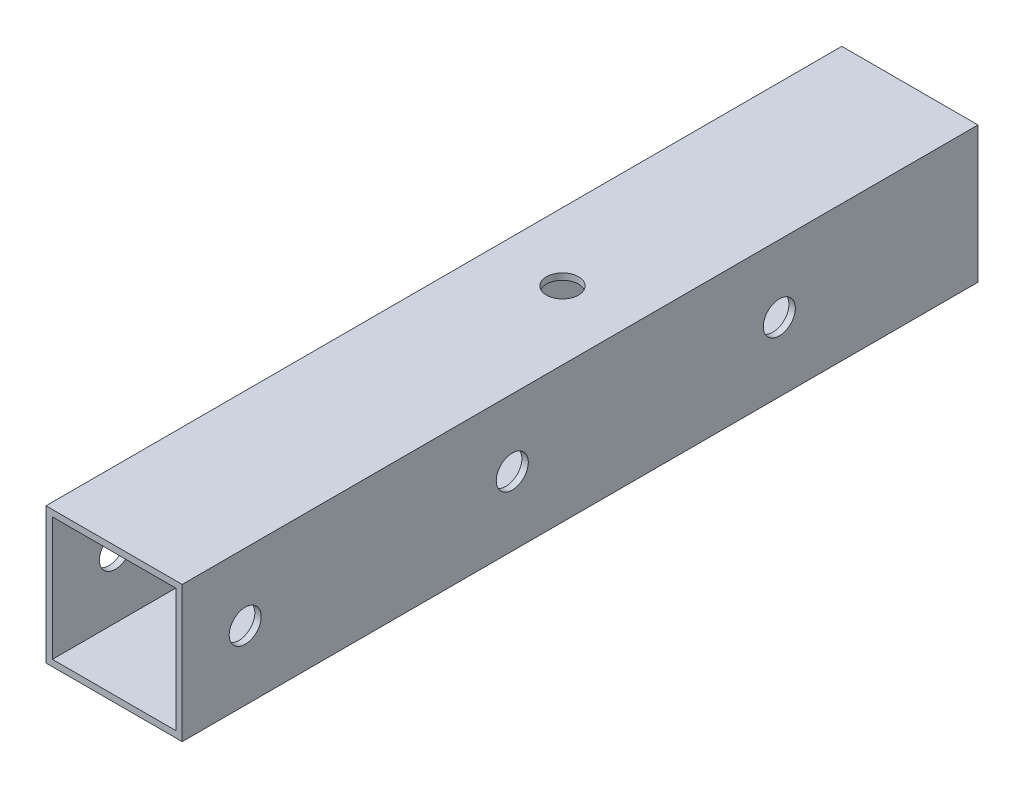
ISO-10303-21;
HEADER;
FILE_DESCRIPTION(('STEP AP214'),'2;1');
FILE_NAME('part.step','',(''),(''),'','','');
FILE_SCHEMA(('AUTOMOTIVE_DESIGN { 1 0 10303 214 1 1 1 1 }'));
ENDSEC;
DATA;
#1=APPLICATION_CONTEXT('core data for automotive mechanical design processes');
#2=APPLICATION_PROTOCOL_DEFINITION('international standard','automotive_design',2000,#1);
#3=PRODUCT_CONTEXT('',#1,'mechanical');
#4=PRODUCT('Part','Part','',(#3));
#5=PRODUCT_RELATED_PRODUCT_CATEGORY('part','',(#4));
#6=PRODUCT_DEFINITION_FORMATION('','',#4);
#7=PRODUCT_DEFINITION_CONTEXT('part definition',#1,'design');
#8=PRODUCT_DEFINITION('design','',#6,#7);
#9=PRODUCT_DEFINITION_SHAPE('','',#8);
#10=(LENGTH_UNIT() NAMED_UNIT(*) SI_UNIT(.MILLI.,.METRE.));
#11=(NAMED_UNIT(*) PLANE_ANGLE_UNIT() SI_UNIT($,.RADIAN.));
#12=(NAMED_UNIT(*) SI_UNIT($,.STERADIAN.) SOLID_ANGLE_UNIT());
#13=UNCERTAINTY_MEASURE_WITH_UNIT(LENGTH_MEASURE(1.E-05),#10,'distance_accuracy_value','');
#14=(GEOMETRIC_REPRESENTATION_CONTEXT(3) GLOBAL_UNCERTAINTY_ASSIGNED_CONTEXT((#13)) GLOBAL_UNIT_ASSIGNED_CONTEXT((#10,
#11,#12)) REPRESENTATION_CONTEXT('',''));
#15=CARTESIAN_POINT('',(0.,0.,0.));
#16=DIRECTION('',(0.,0.,1.));
#17=DIRECTION('',(1.,0.,0.));
#18=AXIS2_PLACEMENT_3D('',#15,#16,#17);
#19=CARTESIAN_POINT('',(0.,0.,149.));
#20=DIRECTION('',(0.,0.,-1.));
#21=DIRECTION('',(-1.,0.,0.));
#22=AXIS2_PLACEMENT_3D('',#19,#20,#21);
#23=PLANE('',#22);
#24=DIRECTION('',(0.,1.,0.));
#25=VECTOR('',#24,1.);
#26=CARTESIAN_POINT('',(12.75,-12.75,149.));
#27=LINE('',#26,#25);
#28=CARTESIAN_POINT('',(12.75,-12.75,149.));
#29=VERTEX_POINT('',#28);
#30=CARTESIAN_POINT('',(12.75,12.75,149.));
#31=VERTEX_POINT('',#30);
#32=EDGE_CURVE('E142',#29,#31,#27,.T.);
#33=ORIENTED_EDGE('',*,*,#32,.T.);
#34=DIRECTION('',(-1.,0.,0.));
#35=VECTOR('',#34,1.);
#36=CARTESIAN_POINT('',(-12.75,12.75,149.));
#37=LINE('',#36,#35);
#38=CARTESIAN_POINT('',(-12.75,12.75,149.));
#39=VERTEX_POINT('',#38);
#40=EDGE_CURVE('E145',#31,#39,#37,.T.);
#41=ORIENTED_EDGE('',*,*,#40,.T.);
#42=DIRECTION('',(0.,-1.,0.));
#43=VECTOR('',#42,1.);
#44=CARTESIAN_POINT('',(-12.75,-12.75,149.));
#45=LINE('',#44,#43);
#46=CARTESIAN_POINT('',(-12.75,-12.75,149.));
#47=VERTEX_POINT('',#46);
#48=EDGE_CURVE('E148',#39,#47,#45,.T.);
#49=ORIENTED_EDGE('',*,*,#48,.T.);
#50=DIRECTION('',(1.,0.,0.));
#51=VECTOR('',#50,1.);
#52=CARTESIAN_POINT('',(-12.75,-12.75,149.));
#53=LINE('',#52,#51);
#54=EDGE_CURVE('E150',#47,#29,#53,.T.);
#55=ORIENTED_EDGE('',*,*,#54,.T.);
#56=EDGE_LOOP('',(#33,#41,#49,#55));
#57=FACE_BOUND('',#56,.T.);
#58=DIRECTION('',(0.,-1.,0.));
#59=VECTOR('',#58,1.);
#60=CARTESIAN_POINT('',(-11.55,-11.55,149.));
#61=LINE('',#60,#59);
#62=CARTESIAN_POINT('',(-11.55,11.55,149.));
#63=VERTEX_POINT('',#62);
#64=CARTESIAN_POINT('',(-11.55,-11.55,149.));
#65=VERTEX_POINT('',#64);
#66=EDGE_CURVE('E104',#63,#65,#61,.T.);
#67=ORIENTED_EDGE('',*,*,#66,.F.);
#68=DIRECTION('',(-1.,0.,0.));
#69=VECTOR('',#68,1.);
#70=CARTESIAN_POINT('',(11.55,11.55,149.));
#71=LINE('',#70,#69);
#72=CARTESIAN_POINT('',(11.55,11.55,149.));
#73=VERTEX_POINT('',#72);
#74=EDGE_CURVE('E126',#73,#63,#71,.T.);
#75=ORIENTED_EDGE('',*,*,#74,.F.);
#76=DIRECTION('',(0.,1.,0.));
#77=VECTOR('',#76,1.);
#78=CARTESIAN_POINT('',(11.55,-11.55,149.));
#79=LINE('',#78,#77);
#80=CARTESIAN_POINT('',(11.55,-11.55,149.));
#81=VERTEX_POINT('',#80);
#82=EDGE_CURVE('E124',#81,#73,#79,.T.);
#83=ORIENTED_EDGE('',*,*,#82,.F.);
#84=DIRECTION('',(1.,0.,0.));
#85=VECTOR('',#84,1.);
#86=CARTESIAN_POINT('',(11.55,-11.55,149.));
#87=LINE('',#86,#85);
#88=EDGE_CURVE('E112',#65,#81,#87,.T.);
#89=ORIENTED_EDGE('',*,*,#88,.F.);
#90=EDGE_LOOP('',(#67,#75,#83,#89));
#91=FACE_BOUND('',#90,.T.);
#92=ADVANCED_FACE('F37',(#57,#91),#23,.F.);
#93=CARTESIAN_POINT('',(0.,0.,0.));
#94=DIRECTION('',(0.,0.,-1.));
#95=DIRECTION('',(-1.,0.,0.));
#96=AXIS2_PLACEMENT_3D('',#93,#94,#95);
#97=PLANE('',#96);
#98=DIRECTION('',(0.,1.,0.));
#99=VECTOR('',#98,1.);
#100=CARTESIAN_POINT('',(12.75,-12.75,0.));
#101=LINE('',#100,#99);
#102=CARTESIAN_POINT('',(12.75,-12.75,0.));
#103=VERTEX_POINT('',#102);
#104=CARTESIAN_POINT('',(12.75,12.75,0.));
#105=VERTEX_POINT('',#104);
#106=EDGE_CURVE('E120',#103,#105,#101,.T.);
#107=ORIENTED_EDGE('',*,*,#106,.F.);
#108=DIRECTION('',(1.,0.,0.));
#109=VECTOR('',#108,1.);
#110=CARTESIAN_POINT('',(-12.75,-12.75,0.));
#111=LINE('',#110,#109);
#112=CARTESIAN_POINT('',(-12.75,-12.75,0.));
#113=VERTEX_POINT('',#112);
#114=EDGE_CURVE('E146',#113,#103,#111,.T.);
#115=ORIENTED_EDGE('',*,*,#114,.F.);
#116=DIRECTION('',(0.,-1.,0.));
#117=VECTOR('',#116,1.);
#118=CARTESIAN_POINT('',(-12.75,-12.75,0.));
#119=LINE('',#118,#117);
#120=CARTESIAN_POINT('',(-12.75,12.75,0.));
#121=VERTEX_POINT('',#120);
#122=EDGE_CURVE('E157',#121,#113,#119,.T.);
#123=ORIENTED_EDGE('',*,*,#122,.F.);
#124=DIRECTION('',(-1.,0.,0.));
#125=VECTOR('',#124,1.);
#126=CARTESIAN_POINT('',(-12.75,12.75,0.));
#127=LINE('',#126,#125);
#128=EDGE_CURVE('E155',#105,#121,#127,.T.);
#129=ORIENTED_EDGE('',*,*,#128,.F.);
#130=EDGE_LOOP('',(#107,#115,#123,#129));
#131=FACE_BOUND('',#130,.T.);
#132=DIRECTION('',(-1.,0.,0.));
#133=VECTOR('',#132,1.);
#134=CARTESIAN_POINT('',(11.55,11.55,0.));
#135=LINE('',#134,#133);
#136=CARTESIAN_POINT('',(11.55,11.55,0.));
#137=VERTEX_POINT('',#136);
#138=CARTESIAN_POINT('',(-11.55,11.55,0.));
#139=VERTEX_POINT('',#138);
#140=EDGE_CURVE('E113',#137,#139,#135,.T.);
#141=ORIENTED_EDGE('',*,*,#140,.T.);
#142=DIRECTION('',(0.,-1.,0.));
#143=VECTOR('',#142,1.);
#144=CARTESIAN_POINT('',(-11.55,-11.55,0.));
#145=LINE('',#144,#143);
#146=CARTESIAN_POINT('',(-11.55,-11.55,0.));
#147=VERTEX_POINT('',#146);
#148=EDGE_CURVE('E62',#139,#147,#145,.T.);
#149=ORIENTED_EDGE('',*,*,#148,.T.);
#150=DIRECTION('',(1.,0.,0.));
#151=VECTOR('',#150,1.);
#152=CARTESIAN_POINT('',(11.55,-11.55,0.));
#153=LINE('',#152,#151);
#154=CARTESIAN_POINT('',(11.55,-11.55,0.));
#155=VERTEX_POINT('',#154);
#156=EDGE_CURVE('E119',#147,#155,#153,.T.);
#157=ORIENTED_EDGE('',*,*,#156,.T.);
#158=DIRECTION('',(0.,1.,0.));
#159=VECTOR('',#158,1.);
#160=CARTESIAN_POINT('',(11.55,-11.55,0.));
#161=LINE('',#160,#159);
#162=EDGE_CURVE('E134',#155,#137,#161,.T.);
#163=ORIENTED_EDGE('',*,*,#162,.T.);
#164=EDGE_LOOP('',(#141,#149,#157,#163));
#165=FACE_BOUND('',#164,.T.);
#166=ADVANCED_FACE('F228',(#131,#165),#97,.T.);
#167=CARTESIAN_POINT('',(12.75,-12.75,149.));
#168=DIRECTION('',(-1.,0.,0.));
#169=DIRECTION('',(0.,-1.,0.));
#170=AXIS2_PLACEMENT_3D('',#167,#168,#169);
#171=PLANE('',#170);
#172=CARTESIAN_POINT('',(12.75,0.150000000001066,37.2000000000035));
#173=DIRECTION('',(-1.,0.,0.));
#174=DIRECTION('',(0.,0.,1.));
#175=AXIS2_PLACEMENT_3D('',#172,#173,#174);
#176=CIRCLE('',#175,3.);
#177=CARTESIAN_POINT('',(12.75,0.150000000001066,40.2000000000035));
#178=VERTEX_POINT('',#177);
#179=EDGE_CURVE('E316',#178,#178,#176,.T.);
#180=ORIENTED_EDGE('',*,*,#179,.T.);
#181=EDGE_LOOP('',(#180));
#182=FACE_BOUND('',#181,.T.);
#183=CARTESIAN_POINT('',(12.75,0.150000000001066,87.2000000000036));
#184=DIRECTION('',(-1.,0.,0.));
#185=DIRECTION('',(0.,0.,1.));
#186=AXIS2_PLACEMENT_3D('',#183,#184,#185);
#187=CIRCLE('',#186,3.);
#188=CARTESIAN_POINT('',(12.75,0.150000000001066,90.2000000000036));
#189=VERTEX_POINT('',#188);
#190=EDGE_CURVE('E179',#189,#189,#187,.T.);
#191=ORIENTED_EDGE('',*,*,#190,.T.);
#192=EDGE_LOOP('',(#191));
#193=FACE_BOUND('',#192,.T.);
#194=CARTESIAN_POINT('',(12.75,0.150000000001066,137.200000000004));
#195=DIRECTION('',(-1.,0.,0.));
#196=DIRECTION('',(0.,0.,1.));
#197=AXIS2_PLACEMENT_3D('',#194,#195,#196);
#198=CIRCLE('',#197,3.);
#199=CARTESIAN_POINT('',(12.75,0.150000000001066,140.200000000004));
#200=VERTEX_POINT('',#199);
#201=EDGE_CURVE('E175',#200,#200,#198,.T.);
#202=ORIENTED_EDGE('',*,*,#201,.T.);
#203=EDGE_LOOP('',(#202));
#204=FACE_BOUND('',#203,.T.);
#205=ORIENTED_EDGE('',*,*,#106,.T.);
#206=DIRECTION('',(0.,0.,-1.));
#207=VECTOR('',#206,1.);
#208=CARTESIAN_POINT('',(12.75,12.75,149.));
#209=LINE('',#208,#207);
#210=EDGE_CURVE('E11',#31,#105,#209,.T.);
#211=ORIENTED_EDGE('',*,*,#210,.F.);
#212=ORIENTED_EDGE('',*,*,#32,.F.);
#213=DIRECTION('',(0.,0.,-1.));
#214=VECTOR('',#213,1.);
#215=CARTESIAN_POINT('',(12.75,-12.75,149.));
#216=LINE('',#215,#214);
#217=EDGE_CURVE('E152',#29,#103,#216,.T.);
#218=ORIENTED_EDGE('',*,*,#217,.T.);
#219=EDGE_LOOP('',(#205,#211,#212,#218));
#220=FACE_BOUND('',#219,.T.);
#221=ADVANCED_FACE('F39',(#182,#193,#204,#220),#171,.F.);
#222=CARTESIAN_POINT('',(-12.75,12.75,149.));
#223=DIRECTION('',(0.,-1.,0.));
#224=DIRECTION('',(0.,0.,-1.));
#225=AXIS2_PLACEMENT_3D('',#222,#223,#224);
#226=PLANE('',#225);
#227=CARTESIAN_POINT('',(-0.0500000000000778,12.75,65.0000000000009));
#228=DIRECTION('',(0.,-1.,0.));
#229=DIRECTION('',(0.,0.,-1.));
#230=AXIS2_PLACEMENT_3D('',#227,#228,#229);
#231=CIRCLE('',#230,2.99999999999999);
#232=CARTESIAN_POINT('',(-0.0500000000000778,12.75,62.0000000000009));
#233=VERTEX_POINT('',#232);
#234=EDGE_CURVE('E171',#233,#233,#231,.T.);
#235=ORIENTED_EDGE('',*,*,#234,.T.);
#236=EDGE_LOOP('',(#235));
#237=FACE_BOUND('',#236,.T.);
#238=ORIENTED_EDGE('',*,*,#128,.T.);
#239=DIRECTION('',(0.,0.,-1.));
#240=VECTOR('',#239,1.);
#241=CARTESIAN_POINT('',(-12.75,12.75,149.));
#242=LINE('',#241,#240);
#243=EDGE_CURVE('E46',#39,#121,#242,.T.);
#244=ORIENTED_EDGE('',*,*,#243,.F.);
#245=ORIENTED_EDGE('',*,*,#40,.F.);
#246=ORIENTED_EDGE('',*,*,#210,.T.);
#247=EDGE_LOOP('',(#238,#244,#245,#246));
#248=FACE_BOUND('',#247,.T.);
#249=ADVANCED_FACE('F243',(#237,#248),#226,.F.);
#250=CARTESIAN_POINT('',(-12.75,-12.75,149.));
#251=DIRECTION('',(1.,0.,0.));
#252=DIRECTION('',(0.,0.,-1.));
#253=AXIS2_PLACEMENT_3D('',#250,#251,#252);
#254=PLANE('',#253);
#255=CARTESIAN_POINT('',(-12.75,0.150000000001066,37.2000000000035));
#256=DIRECTION('',(-1.,0.,0.));
#257=DIRECTION('',(0.,0.,1.));
#258=AXIS2_PLACEMENT_3D('',#255,#256,#257);
#259=CIRCLE('',#258,2.99999999999999);
#260=CARTESIAN_POINT('',(-12.75,0.150000000001066,40.2000000000035));
#261=VERTEX_POINT('',#260);
#262=EDGE_CURVE('E315',#261,#261,#259,.T.);
#263=ORIENTED_EDGE('',*,*,#262,.F.);
#264=EDGE_LOOP('',(#263));
#265=FACE_BOUND('',#264,.T.);
#266=CARTESIAN_POINT('',(-12.75,0.150000000001066,87.2000000000036));
#267=DIRECTION('',(-1.,0.,0.));
#268=DIRECTION('',(0.,0.,1.));
#269=AXIS2_PLACEMENT_3D('',#266,#267,#268);
#270=CIRCLE('',#269,2.99999999999999);
#271=CARTESIAN_POINT('',(-12.75,0.150000000001066,90.2000000000035));
#272=VERTEX_POINT('',#271);
#273=EDGE_CURVE('E186',#272,#272,#270,.T.);
#274=ORIENTED_EDGE('',*,*,#273,.F.);
#275=EDGE_LOOP('',(#274));
#276=FACE_BOUND('',#275,.T.);
#277=CARTESIAN_POINT('',(-12.75,0.150000000001066,137.200000000004));
#278=DIRECTION('',(-1.,0.,0.));
#279=DIRECTION('',(0.,0.,1.));
#280=AXIS2_PLACEMENT_3D('',#277,#278,#279);
#281=CIRCLE('',#280,2.99999999999999);
#282=CARTESIAN_POINT('',(-12.75,0.150000000001066,140.200000000004));
#283=VERTEX_POINT('',#282);
#284=EDGE_CURVE('E183',#283,#283,#281,.T.);
#285=ORIENTED_EDGE('',*,*,#284,.F.);
#286=EDGE_LOOP('',(#285));
#287=FACE_BOUND('',#286,.T.);
#288=ORIENTED_EDGE('',*,*,#122,.T.);
#289=DIRECTION('',(0.,0.,-1.));
#290=VECTOR('',#289,1.);
#291=CARTESIAN_POINT('',(-12.75,-12.75,149.));
#292=LINE('',#291,#290);
#293=EDGE_CURVE('E162',#47,#113,#292,.T.);
#294=ORIENTED_EDGE('',*,*,#293,.F.);
#295=ORIENTED_EDGE('',*,*,#48,.F.);
#296=ORIENTED_EDGE('',*,*,#243,.T.);
#297=EDGE_LOOP('',(#288,#294,#295,#296));
#298=FACE_BOUND('',#297,.T.);
#299=ADVANCED_FACE('F241',(#265,#276,#287,#298),#254,.F.);
#300=CARTESIAN_POINT('',(-12.75,-12.75,149.));
#301=DIRECTION('',(0.,1.,0.));
#302=DIRECTION('',(0.,0.,1.));
#303=AXIS2_PLACEMENT_3D('',#300,#301,#302);
#304=PLANE('',#303);
#305=CARTESIAN_POINT('',(-0.0500000000000778,-12.75,65.0000000000009));
#306=DIRECTION('',(0.,1.,0.));
#307=DIRECTION('',(0.,0.,1.));
#308=AXIS2_PLACEMENT_3D('',#305,#306,#307);
#309=CIRCLE('',#308,2.99999999999999);
#310=CARTESIAN_POINT('',(-0.0500000000000778,-12.75,68.0000000000009));
#311=VERTEX_POINT('',#310);
#312=EDGE_CURVE('E132',#311,#311,#309,.T.);
#313=ORIENTED_EDGE('',*,*,#312,.T.);
#314=EDGE_LOOP('',(#313));
#315=FACE_BOUND('',#314,.T.);
#316=ORIENTED_EDGE('',*,*,#114,.T.);
#317=ORIENTED_EDGE('',*,*,#217,.F.);
#318=ORIENTED_EDGE('',*,*,#54,.F.);
#319=ORIENTED_EDGE('',*,*,#293,.T.);
#320=EDGE_LOOP('',(#316,#317,#318,#319));
#321=FACE_BOUND('',#320,.T.);
#322=ADVANCED_FACE('F207',(#315,#321),#304,.F.);
#323=CARTESIAN_POINT('',(-11.55,-11.55,149.));
#324=DIRECTION('',(1.,0.,0.));
#325=DIRECTION('',(0.,0.,-1.));
#326=AXIS2_PLACEMENT_3D('',#323,#324,#325);
#327=PLANE('',#326);
#328=CARTESIAN_POINT('',(-11.55,0.150000000001066,37.2000000000035));
#329=DIRECTION('',(1.,0.,0.));
#330=DIRECTION('',(0.,0.,-1.));
#331=AXIS2_PLACEMENT_3D('',#328,#329,#330);
#332=CIRCLE('',#331,2.99999999999999);
#333=CARTESIAN_POINT('',(-11.55,0.150000000001066,34.2000000000036));
#334=VERTEX_POINT('',#333);
#335=EDGE_CURVE('E41',#334,#334,#332,.T.);
#336=ORIENTED_EDGE('',*,*,#335,.F.);
#337=EDGE_LOOP('',(#336));
#338=FACE_BOUND('',#337,.T.);
#339=CARTESIAN_POINT('',(-11.55,0.150000000001066,87.2000000000036));
#340=DIRECTION('',(1.,0.,0.));
#341=DIRECTION('',(0.,0.,-1.));
#342=AXIS2_PLACEMENT_3D('',#339,#340,#341);
#343=CIRCLE('',#342,2.99999999999999);
#344=CARTESIAN_POINT('',(-11.55,0.150000000001066,84.2000000000036));
#345=VERTEX_POINT('',#344);
#346=EDGE_CURVE('E178',#345,#345,#343,.T.);
#347=ORIENTED_EDGE('',*,*,#346,.F.);
#348=EDGE_LOOP('',(#347));
#349=FACE_BOUND('',#348,.T.);
#350=CARTESIAN_POINT('',(-11.55,0.150000000001066,137.200000000004));
#351=DIRECTION('',(1.,0.,0.));
#352=DIRECTION('',(0.,0.,-1.));
#353=AXIS2_PLACEMENT_3D('',#350,#351,#352);
#354=CIRCLE('',#353,2.99999999999999);
#355=CARTESIAN_POINT('',(-11.55,0.150000000001066,134.200000000004));
#356=VERTEX_POINT('',#355);
#357=EDGE_CURVE('E174',#356,#356,#354,.T.);
#358=ORIENTED_EDGE('',*,*,#357,.F.);
#359=EDGE_LOOP('',(#358));
#360=FACE_BOUND('',#359,.T.);
#361=ORIENTED_EDGE('',*,*,#148,.F.);
#362=DIRECTION('',(0.,0.,-1.));
#363=VECTOR('',#362,1.);
#364=CARTESIAN_POINT('',(-11.55,11.55,149.));
#365=LINE('',#364,#363);
#366=EDGE_CURVE('E108',#63,#139,#365,.T.);
#367=ORIENTED_EDGE('',*,*,#366,.F.);
#368=ORIENTED_EDGE('',*,*,#66,.T.);
#369=DIRECTION('',(0.,0.,-1.));
#370=VECTOR('',#369,1.);
#371=CARTESIAN_POINT('',(-11.55,-11.55,149.));
#372=LINE('',#371,#370);
#373=EDGE_CURVE('E107',#65,#147,#372,.T.);
#374=ORIENTED_EDGE('',*,*,#373,.T.);
#375=EDGE_LOOP('',(#361,#367,#368,#374));
#376=FACE_BOUND('',#375,.T.);
#377=ADVANCED_FACE('F106',(#338,#349,#360,#376),#327,.T.);
#378=CARTESIAN_POINT('',(11.55,-11.55,149.));
#379=DIRECTION('',(0.,1.,0.));
#380=DIRECTION('',(0.,0.,1.));
#381=AXIS2_PLACEMENT_3D('',#378,#379,#380);
#382=PLANE('',#381);
#383=CARTESIAN_POINT('',(-0.0500000000000778,-11.55,65.0000000000009));
#384=DIRECTION('',(0.,1.,0.));
#385=DIRECTION('',(0.,0.,1.));
#386=AXIS2_PLACEMENT_3D('',#383,#384,#385);
#387=CIRCLE('',#386,2.99999999999999);
#388=CARTESIAN_POINT('',(-0.0500000000000778,-11.55,68.0000000000009));
#389=VERTEX_POINT('',#388);
#390=EDGE_CURVE('E170',#389,#389,#387,.T.);
#391=ORIENTED_EDGE('',*,*,#390,.F.);
#392=EDGE_LOOP('',(#391));
#393=FACE_BOUND('',#392,.T.);
#394=ORIENTED_EDGE('',*,*,#156,.F.);
#395=ORIENTED_EDGE('',*,*,#373,.F.);
#396=ORIENTED_EDGE('',*,*,#88,.T.);
#397=DIRECTION('',(0.,0.,-1.));
#398=VECTOR('',#397,1.);
#399=CARTESIAN_POINT('',(11.55,-11.55,149.));
#400=LINE('',#399,#398);
#401=EDGE_CURVE('E121',#81,#155,#400,.T.);
#402=ORIENTED_EDGE('',*,*,#401,.T.);
#403=EDGE_LOOP('',(#394,#395,#396,#402));
#404=FACE_BOUND('',#403,.T.);
#405=ADVANCED_FACE('F116',(#393,#404),#382,.T.);
#406=CARTESIAN_POINT('',(11.55,-11.55,149.));
#407=DIRECTION('',(-1.,0.,0.));
#408=DIRECTION('',(0.,0.,1.));
#409=AXIS2_PLACEMENT_3D('',#406,#407,#408);
#410=PLANE('',#409);
#411=CARTESIAN_POINT('',(11.55,0.150000000001066,37.2000000000035));
#412=DIRECTION('',(-1.,0.,0.));
#413=DIRECTION('',(0.,0.,1.));
#414=AXIS2_PLACEMENT_3D('',#411,#412,#413);
#415=CIRCLE('',#414,2.99999999999999);
#416=CARTESIAN_POINT('',(11.55,0.150000000001066,40.2000000000035));
#417=VERTEX_POINT('',#416);
#418=EDGE_CURVE('E191',#417,#417,#415,.T.);
#419=ORIENTED_EDGE('',*,*,#418,.F.);
#420=EDGE_LOOP('',(#419));
#421=FACE_BOUND('',#420,.T.);
#422=CARTESIAN_POINT('',(11.55,0.150000000001066,87.2000000000036));
#423=DIRECTION('',(-1.,0.,0.));
#424=DIRECTION('',(0.,0.,1.));
#425=AXIS2_PLACEMENT_3D('',#422,#423,#424);
#426=CIRCLE('',#425,2.99999999999999);
#427=CARTESIAN_POINT('',(11.55,0.150000000001066,90.2000000000035));
#428=VERTEX_POINT('',#427);
#429=EDGE_CURVE('E176',#428,#428,#426,.T.);
#430=ORIENTED_EDGE('',*,*,#429,.F.);
#431=EDGE_LOOP('',(#430));
#432=FACE_BOUND('',#431,.T.);
#433=CARTESIAN_POINT('',(11.55,0.150000000001066,137.200000000004));
#434=DIRECTION('',(-1.,0.,0.));
#435=DIRECTION('',(0.,0.,1.));
#436=AXIS2_PLACEMENT_3D('',#433,#434,#435);
#437=CIRCLE('',#436,2.99999999999999);
#438=CARTESIAN_POINT('',(11.55,0.150000000001066,140.200000000004));
#439=VERTEX_POINT('',#438);
#440=EDGE_CURVE('E172',#439,#439,#437,.T.);
#441=ORIENTED_EDGE('',*,*,#440,.F.);
#442=EDGE_LOOP('',(#441));
#443=FACE_BOUND('',#442,.T.);
#444=ORIENTED_EDGE('',*,*,#162,.F.);
#445=ORIENTED_EDGE('',*,*,#401,.F.);
#446=ORIENTED_EDGE('',*,*,#82,.T.);
#447=DIRECTION('',(0.,0.,-1.));
#448=VECTOR('',#447,1.);
#449=CARTESIAN_POINT('',(11.55,11.55,149.));
#450=LINE('',#449,#448);
#451=EDGE_CURVE('E54',#73,#137,#450,.T.);
#452=ORIENTED_EDGE('',*,*,#451,.T.);
#453=EDGE_LOOP('',(#444,#445,#446,#452));
#454=FACE_BOUND('',#453,.T.);
#455=ADVANCED_FACE('F267',(#421,#432,#443,#454),#410,.T.);
#456=CARTESIAN_POINT('',(11.55,11.55,149.));
#457=DIRECTION('',(0.,-1.,0.));
#458=DIRECTION('',(0.,0.,-1.));
#459=AXIS2_PLACEMENT_3D('',#456,#457,#458);
#460=PLANE('',#459);
#461=CARTESIAN_POINT('',(-0.0500000000000778,11.55,65.0000000000009));
#462=DIRECTION('',(0.,-1.,0.));
#463=DIRECTION('',(0.,0.,-1.));
#464=AXIS2_PLACEMENT_3D('',#461,#462,#463);
#465=CIRCLE('',#464,2.99999999999999);
#466=CARTESIAN_POINT('',(-0.0500000000000778,11.55,62.0000000000009));
#467=VERTEX_POINT('',#466);
#468=EDGE_CURVE('E167',#467,#467,#465,.T.);
#469=ORIENTED_EDGE('',*,*,#468,.F.);
#470=EDGE_LOOP('',(#469));
#471=FACE_BOUND('',#470,.T.);
#472=ORIENTED_EDGE('',*,*,#140,.F.);
#473=ORIENTED_EDGE('',*,*,#451,.F.);
#474=ORIENTED_EDGE('',*,*,#74,.T.);
#475=ORIENTED_EDGE('',*,*,#366,.T.);
#476=EDGE_LOOP('',(#472,#473,#474,#475));
#477=FACE_BOUND('',#476,.T.);
#478=ADVANCED_FACE('F224',(#471,#477),#460,.T.);
#479=CARTESIAN_POINT('',(-0.0500000000000778,-21.7500000000003,65.0000000000009));
#480=DIRECTION('',(0.,-1.,0.));
#481=DIRECTION('',(0.,0.,-1.));
#482=AXIS2_PLACEMENT_3D('',#479,#480,#481);
#483=CYLINDRICAL_SURFACE('',#482,2.99999999999999);
#484=ORIENTED_EDGE('',*,*,#468,.T.);
#485=EDGE_LOOP('',(#484));
#486=FACE_BOUND('',#485,.T.);
#487=ORIENTED_EDGE('',*,*,#234,.F.);
#488=EDGE_LOOP('',(#487));
#489=FACE_BOUND('',#488,.T.);
#490=ADVANCED_FACE('F213',(#486,#489),#483,.F.);
#491=ORIENTED_EDGE('',*,*,#390,.T.);
#492=EDGE_LOOP('',(#491));
#493=FACE_BOUND('',#492,.T.);
#494=ORIENTED_EDGE('',*,*,#312,.F.);
#495=EDGE_LOOP('',(#494));
#496=FACE_BOUND('',#495,.T.);
#497=ADVANCED_FACE('F210',(#493,#496),#483,.F.);
#498=CARTESIAN_POINT('',(-12.75,0.150000000001066,137.200000000004));
#499=DIRECTION('',(-1.,0.,0.));
#500=DIRECTION('',(0.,0.,1.));
#501=AXIS2_PLACEMENT_3D('',#498,#499,#500);
#502=CYLINDRICAL_SURFACE('',#501,2.99999999999999);
#503=ORIENTED_EDGE('',*,*,#440,.T.);
#504=EDGE_LOOP('',(#503));
#505=FACE_BOUND('',#504,.T.);
#506=ORIENTED_EDGE('',*,*,#201,.F.);
#507=EDGE_LOOP('',(#506));
#508=FACE_BOUND('',#507,.T.);
#509=ADVANCED_FACE('F212',(#505,#508),#502,.F.);
#510=ORIENTED_EDGE('',*,*,#357,.T.);
#511=EDGE_LOOP('',(#510));
#512=FACE_BOUND('',#511,.T.);
#513=ORIENTED_EDGE('',*,*,#284,.T.);
#514=EDGE_LOOP('',(#513));
#515=FACE_BOUND('',#514,.T.);
#516=ADVANCED_FACE('F221',(#512,#515),#502,.F.);
#517=CARTESIAN_POINT('',(-12.75,0.150000000001066,87.2000000000036));
#518=DIRECTION('',(-1.,0.,0.));
#519=DIRECTION('',(0.,0.,1.));
#520=AXIS2_PLACEMENT_3D('',#517,#518,#519);
#521=CYLINDRICAL_SURFACE('',#520,2.99999999999999);
#522=ORIENTED_EDGE('',*,*,#429,.T.);
#523=EDGE_LOOP('',(#522));
#524=FACE_BOUND('',#523,.T.);
#525=ORIENTED_EDGE('',*,*,#190,.F.);
#526=EDGE_LOOP('',(#525));
#527=FACE_BOUND('',#526,.T.);
#528=ADVANCED_FACE('F293',(#524,#527),#521,.F.);
#529=ORIENTED_EDGE('',*,*,#346,.T.);
#530=EDGE_LOOP('',(#529));
#531=FACE_BOUND('',#530,.T.);
#532=ORIENTED_EDGE('',*,*,#273,.T.);
#533=EDGE_LOOP('',(#532));
#534=FACE_BOUND('',#533,.T.);
#535=ADVANCED_FACE('F299',(#531,#534),#521,.F.);
#536=CARTESIAN_POINT('',(-12.75,0.150000000001066,37.2000000000035));
#537=DIRECTION('',(-1.,0.,0.));
#538=DIRECTION('',(0.,0.,1.));
#539=AXIS2_PLACEMENT_3D('',#536,#537,#538);
#540=CYLINDRICAL_SURFACE('',#539,2.99999999999999);
#541=ORIENTED_EDGE('',*,*,#335,.T.);
#542=EDGE_LOOP('',(#541));
#543=FACE_BOUND('',#542,.T.);
#544=ORIENTED_EDGE('',*,*,#262,.T.);
#545=EDGE_LOOP('',(#544));
#546=FACE_BOUND('',#545,.T.);
#547=ADVANCED_FACE('F302',(#543,#546),#540,.F.);
#548=ORIENTED_EDGE('',*,*,#418,.T.);
#549=EDGE_LOOP('',(#548));
#550=FACE_BOUND('',#549,.T.);
#551=ORIENTED_EDGE('',*,*,#179,.F.);
#552=EDGE_LOOP('',(#551));
#553=FACE_BOUND('',#552,.T.);
#554=ADVANCED_FACE('F304',(#550,#553),#540,.F.);
#555=CLOSED_SHELL('',(#92,#166,#221,#249,#299,#322,#377,#405,#455,#478,#490,#497,#509,#516,#528,
#535,#547,#554));
#556=MANIFOLD_SOLID_BREP('B2',#555);
#557=ADVANCED_BREP_SHAPE_REPRESENTATION('',(#18,#556),#14);
#558=SHAPE_DEFINITION_REPRESENTATION(#9,#557);
ENDSEC;
END-ISO-10303-21;
